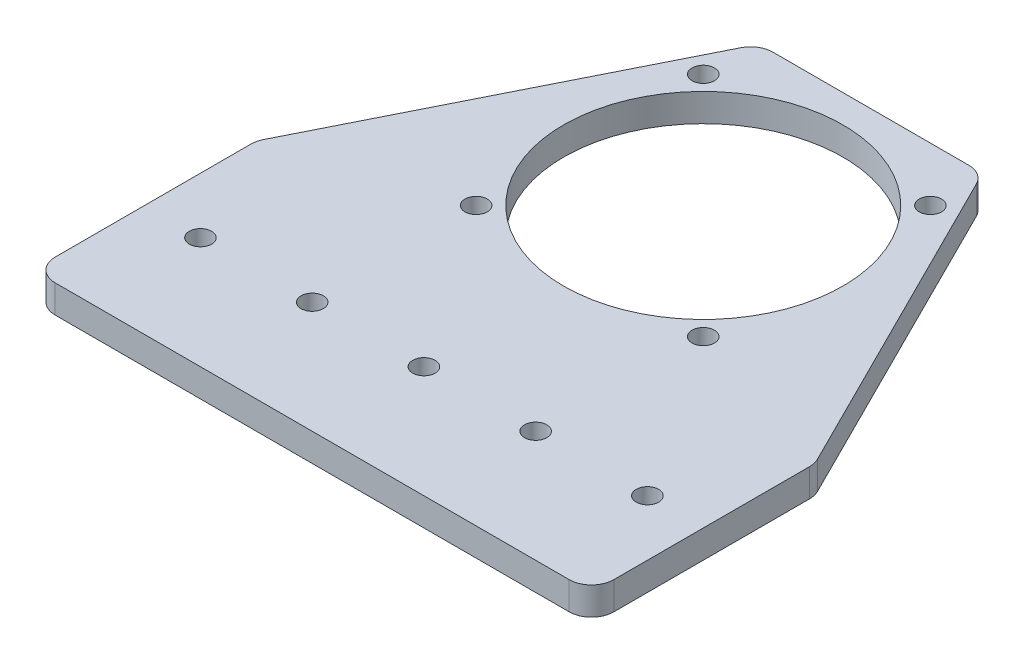
ISO-10303-21;
HEADER;
FILE_DESCRIPTION(('STEP AP214'),'2;1');
FILE_NAME('part.step','',(''),(''),'','','');
FILE_SCHEMA(('AUTOMOTIVE_DESIGN { 1 0 10303 214 1 1 1 1 }'));
ENDSEC;
DATA;
#1=APPLICATION_CONTEXT('core data for automotive mechanical design processes');
#2=APPLICATION_PROTOCOL_DEFINITION('international standard','automotive_design',2000,#1);
#3=PRODUCT_CONTEXT('',#1,'mechanical');
#4=PRODUCT('Part','Part','',(#3));
#5=PRODUCT_RELATED_PRODUCT_CATEGORY('part','',(#4));
#6=PRODUCT_DEFINITION_FORMATION('','',#4);
#7=PRODUCT_DEFINITION_CONTEXT('part definition',#1,'design');
#8=PRODUCT_DEFINITION('design','',#6,#7);
#9=PRODUCT_DEFINITION_SHAPE('','',#8);
#10=(LENGTH_UNIT() NAMED_UNIT(*) SI_UNIT(.MILLI.,.METRE.));
#11=(NAMED_UNIT(*) PLANE_ANGLE_UNIT() SI_UNIT($,.RADIAN.));
#12=(NAMED_UNIT(*) SI_UNIT($,.STERADIAN.) SOLID_ANGLE_UNIT());
#13=UNCERTAINTY_MEASURE_WITH_UNIT(LENGTH_MEASURE(1.E-05),#10,'distance_accuracy_value','');
#14=(GEOMETRIC_REPRESENTATION_CONTEXT(3) GLOBAL_UNCERTAINTY_ASSIGNED_CONTEXT((#13)) GLOBAL_UNIT_ASSIGNED_CONTEXT((#10,
#11,#12)) REPRESENTATION_CONTEXT('',''));
#15=CARTESIAN_POINT('',(0.,0.,0.));
#16=DIRECTION('',(0.,0.,1.));
#17=DIRECTION('',(1.,0.,0.));
#18=AXIS2_PLACEMENT_3D('',#15,#16,#17);
#19=CARTESIAN_POINT('',(25.4,3.175,19.05));
#20=DIRECTION('',(0.,-1.,0.));
#21=DIRECTION('',(0.,0.,-1.));
#22=AXIS2_PLACEMENT_3D('',#19,#20,#21);
#23=CYLINDRICAL_SURFACE('',#22,1.27);
#24=CARTESIAN_POINT('',(25.4,3.175,19.05));
#25=DIRECTION('',(0.,1.,0.));
#26=DIRECTION('',(0.,0.,1.));
#27=AXIS2_PLACEMENT_3D('',#24,#25,#26);
#28=CIRCLE('',#27,1.27);
#29=CARTESIAN_POINT('',(25.4,3.175,20.32));
#30=VERTEX_POINT('',#29);
#31=EDGE_CURVE('E52',#30,#30,#28,.T.);
#32=ORIENTED_EDGE('',*,*,#31,.T.);
#33=EDGE_LOOP('',(#32));
#34=FACE_BOUND('',#33,.T.);
#35=CARTESIAN_POINT('',(25.4,0.,19.05));
#36=DIRECTION('',(0.,1.,0.));
#37=DIRECTION('',(0.,0.,1.));
#38=AXIS2_PLACEMENT_3D('',#35,#36,#37);
#39=CIRCLE('',#38,1.27);
#40=CARTESIAN_POINT('',(25.4,0.,20.32));
#41=VERTEX_POINT('',#40);
#42=EDGE_CURVE('E11',#41,#41,#39,.T.);
#43=ORIENTED_EDGE('',*,*,#42,.F.);
#44=EDGE_LOOP('',(#43));
#45=FACE_BOUND('',#44,.T.);
#46=ADVANCED_FACE('F45',(#34,#45),#23,.F.);
#47=CARTESIAN_POINT('',(12.7,3.175,19.05));
#48=DIRECTION('',(0.,-1.,0.));
#49=DIRECTION('',(0.,0.,-1.));
#50=AXIS2_PLACEMENT_3D('',#47,#48,#49);
#51=CYLINDRICAL_SURFACE('',#50,1.27);
#52=CARTESIAN_POINT('',(12.7,3.175,19.05));
#53=DIRECTION('',(0.,1.,0.));
#54=DIRECTION('',(0.,0.,1.));
#55=AXIS2_PLACEMENT_3D('',#52,#53,#54);
#56=CIRCLE('',#55,1.27);
#57=CARTESIAN_POINT('',(12.7,3.175,20.32));
#58=VERTEX_POINT('',#57);
#59=EDGE_CURVE('E218',#58,#58,#56,.T.);
#60=ORIENTED_EDGE('',*,*,#59,.T.);
#61=EDGE_LOOP('',(#60));
#62=FACE_BOUND('',#61,.T.);
#63=CARTESIAN_POINT('',(12.7,0.,19.05));
#64=DIRECTION('',(0.,1.,0.));
#65=DIRECTION('',(0.,0.,1.));
#66=AXIS2_PLACEMENT_3D('',#63,#64,#65);
#67=CIRCLE('',#66,1.27);
#68=CARTESIAN_POINT('',(12.7,0.,20.32));
#69=VERTEX_POINT('',#68);
#70=EDGE_CURVE('E221',#69,#69,#67,.T.);
#71=ORIENTED_EDGE('',*,*,#70,.F.);
#72=EDGE_LOOP('',(#71));
#73=FACE_BOUND('',#72,.T.);
#74=ADVANCED_FACE('F358',(#62,#73),#51,.F.);
#75=CARTESIAN_POINT('',(0.,3.175,19.05));
#76=DIRECTION('',(0.,-1.,0.));
#77=DIRECTION('',(0.,0.,-1.));
#78=AXIS2_PLACEMENT_3D('',#75,#76,#77);
#79=CYLINDRICAL_SURFACE('',#78,1.27);
#80=CARTESIAN_POINT('',(0.,3.175,19.05));
#81=DIRECTION('',(0.,1.,0.));
#82=DIRECTION('',(0.,0.,1.));
#83=AXIS2_PLACEMENT_3D('',#80,#81,#82);
#84=CIRCLE('',#83,1.27);
#85=CARTESIAN_POINT('',(0.,3.175,20.32));
#86=VERTEX_POINT('',#85);
#87=EDGE_CURVE('E212',#86,#86,#84,.T.);
#88=ORIENTED_EDGE('',*,*,#87,.T.);
#89=EDGE_LOOP('',(#88));
#90=FACE_BOUND('',#89,.T.);
#91=CARTESIAN_POINT('',(0.,0.,19.05));
#92=DIRECTION('',(0.,1.,0.));
#93=DIRECTION('',(0.,0.,1.));
#94=AXIS2_PLACEMENT_3D('',#91,#92,#93);
#95=CIRCLE('',#94,1.27);
#96=CARTESIAN_POINT('',(0.,0.,20.32));
#97=VERTEX_POINT('',#96);
#98=EDGE_CURVE('E215',#97,#97,#95,.T.);
#99=ORIENTED_EDGE('',*,*,#98,.F.);
#100=EDGE_LOOP('',(#99));
#101=FACE_BOUND('',#100,.T.);
#102=ADVANCED_FACE('F362',(#90,#101),#79,.F.);
#103=CARTESIAN_POINT('',(-12.7,3.175,19.05));
#104=DIRECTION('',(0.,-1.,0.));
#105=DIRECTION('',(0.,0.,-1.));
#106=AXIS2_PLACEMENT_3D('',#103,#104,#105);
#107=CYLINDRICAL_SURFACE('',#106,1.27);
#108=CARTESIAN_POINT('',(-12.7,3.175,19.05));
#109=DIRECTION('',(0.,1.,0.));
#110=DIRECTION('',(0.,0.,1.));
#111=AXIS2_PLACEMENT_3D('',#108,#109,#110);
#112=CIRCLE('',#111,1.27);
#113=CARTESIAN_POINT('',(-12.7,3.175,20.32));
#114=VERTEX_POINT('',#113);
#115=EDGE_CURVE('E206',#114,#114,#112,.T.);
#116=ORIENTED_EDGE('',*,*,#115,.T.);
#117=EDGE_LOOP('',(#116));
#118=FACE_BOUND('',#117,.T.);
#119=CARTESIAN_POINT('',(-12.7,0.,19.05));
#120=DIRECTION('',(0.,1.,0.));
#121=DIRECTION('',(0.,0.,1.));
#122=AXIS2_PLACEMENT_3D('',#119,#120,#121);
#123=CIRCLE('',#122,1.27);
#124=CARTESIAN_POINT('',(-12.7,0.,20.32));
#125=VERTEX_POINT('',#124);
#126=EDGE_CURVE('E209',#125,#125,#123,.T.);
#127=ORIENTED_EDGE('',*,*,#126,.F.);
#128=EDGE_LOOP('',(#127));
#129=FACE_BOUND('',#128,.T.);
#130=ADVANCED_FACE('F367',(#118,#129),#107,.F.);
#131=CARTESIAN_POINT('',(31.75,3.175,0.));
#132=DIRECTION('',(-1.,0.,0.));
#133=DIRECTION('',(0.,0.,1.));
#134=AXIS2_PLACEMENT_3D('',#131,#132,#133);
#135=PLANE('',#134);
#136=DIRECTION('',(0.,0.,-1.));
#137=VECTOR('',#136,1.);
#138=CARTESIAN_POINT('',(31.75,3.175,0.));
#139=LINE('',#138,#137);
#140=CARTESIAN_POINT('',(31.75,3.175,29.21));
#141=VERTEX_POINT('',#140);
#142=CARTESIAN_POINT('',(31.75,3.175,6.94961266284948));
#143=VERTEX_POINT('',#142);
#144=EDGE_CURVE('E313',#141,#143,#139,.T.);
#145=ORIENTED_EDGE('',*,*,#144,.F.);
#146=DIRECTION('',(0.,-1.,0.));
#147=VECTOR('',#146,1.);
#148=CARTESIAN_POINT('',(31.75,3.175,29.21));
#149=LINE('',#148,#147);
#150=CARTESIAN_POINT('',(31.75,0.,29.21));
#151=VERTEX_POINT('',#150);
#152=EDGE_CURVE('E193',#141,#151,#149,.T.);
#153=ORIENTED_EDGE('',*,*,#152,.T.);
#154=DIRECTION('',(0.,0.,-1.));
#155=VECTOR('',#154,1.);
#156=CARTESIAN_POINT('',(31.75,0.,0.));
#157=LINE('',#156,#155);
#158=CARTESIAN_POINT('',(31.75,0.,6.94961266284948));
#159=VERTEX_POINT('',#158);
#160=EDGE_CURVE('E286',#151,#159,#157,.T.);
#161=ORIENTED_EDGE('',*,*,#160,.T.);
#162=DIRECTION('',(0.,-1.,0.));
#163=VECTOR('',#162,1.);
#164=CARTESIAN_POINT('',(31.75,3.175,6.94961266284948));
#165=LINE('',#164,#163);
#166=EDGE_CURVE('E191',#159,#143,#165,.F.);
#167=ORIENTED_EDGE('',*,*,#166,.T.);
#168=EDGE_LOOP('',(#145,#153,#161,#167));
#169=FACE_BOUND('',#168,.T.);
#170=ADVANCED_FACE('F329',(#169),#135,.F.);
#171=CARTESIAN_POINT('',(22.86,3.175,-11.43));
#172=DIRECTION('',(-0.894427190999916,0.,0.447213595499958));
#173=DIRECTION('',(0.447213595499958,0.,0.894427190999916));
#174=AXIS2_PLACEMENT_3D('',#171,#172,#173);
#175=PLANE('',#174);
#176=DIRECTION('',(-0.447213595499958,0.,-0.894427190999916));
#177=VECTOR('',#176,1.);
#178=CARTESIAN_POINT('',(22.86,3.175,-11.43));
#179=LINE('',#178,#177);
#180=CARTESIAN_POINT('',(31.4818450651398,3.175,5.81369013027958));
#181=VERTEX_POINT('',#180);
#182=CARTESIAN_POINT('',(13.402038733715,3.175,-30.3459225325699));
#183=VERTEX_POINT('',#182);
#184=EDGE_CURVE('E310',#181,#183,#179,.T.);
#185=ORIENTED_EDGE('',*,*,#184,.F.);
#186=DIRECTION('',(0.,-1.,0.));
#187=VECTOR('',#186,1.);
#188=CARTESIAN_POINT('',(31.4818450651398,3.175,5.81369013027958));
#189=LINE('',#188,#187);
#190=CARTESIAN_POINT('',(31.4818450651398,0.,5.81369013027958));
#191=VERTEX_POINT('',#190);
#192=EDGE_CURVE('E198',#181,#191,#189,.T.);
#193=ORIENTED_EDGE('',*,*,#192,.T.);
#194=DIRECTION('',(-0.447213595499958,0.,-0.894427190999916));
#195=VECTOR('',#194,1.);
#196=CARTESIAN_POINT('',(22.86,0.,-11.43));
#197=LINE('',#196,#195);
#198=CARTESIAN_POINT('',(13.402038733715,0.,-30.3459225325699));
#199=VERTEX_POINT('',#198);
#200=EDGE_CURVE('E281',#191,#199,#197,.T.);
#201=ORIENTED_EDGE('',*,*,#200,.T.);
#202=DIRECTION('',(0.,-1.,0.));
#203=VECTOR('',#202,1.);
#204=CARTESIAN_POINT('',(13.402038733715,3.175,-30.3459225325699));
#205=LINE('',#204,#203);
#206=EDGE_CURVE('E196',#199,#183,#205,.F.);
#207=ORIENTED_EDGE('',*,*,#206,.T.);
#208=EDGE_LOOP('',(#185,#193,#201,#207));
#209=FACE_BOUND('',#208,.T.);
#210=ADVANCED_FACE('F338',(#209),#175,.F.);
#211=CARTESIAN_POINT('',(0.,3.175,-31.75));
#212=DIRECTION('',(0.,0.,-1.));
#213=DIRECTION('',(-1.,0.,0.));
#214=AXIS2_PLACEMENT_3D('',#211,#212,#213);
#215=PLANE('',#214);
#216=DIRECTION('',(1.,0.,0.));
#217=VECTOR('',#216,1.);
#218=CARTESIAN_POINT('',(0.,3.175,-31.75));
#219=LINE('',#218,#217);
#220=CARTESIAN_POINT('',(-11.1301936685753,3.175,-31.75));
#221=VERTEX_POINT('',#220);
#222=CARTESIAN_POINT('',(11.1301936685753,3.175,-31.75));
#223=VERTEX_POINT('',#222);
#224=EDGE_CURVE('E270',#221,#223,#219,.T.);
#225=ORIENTED_EDGE('',*,*,#224,.T.);
#226=DIRECTION('',(0.,-1.,0.));
#227=VECTOR('',#226,1.);
#228=CARTESIAN_POINT('',(11.1301936685753,0.,-31.75));
#229=LINE('',#228,#227);
#230=CARTESIAN_POINT('',(11.1301936685753,0.,-31.75));
#231=VERTEX_POINT('',#230);
#232=EDGE_CURVE('E203',#223,#231,#229,.T.);
#233=ORIENTED_EDGE('',*,*,#232,.T.);
#234=DIRECTION('',(1.,0.,0.));
#235=VECTOR('',#234,1.);
#236=CARTESIAN_POINT('',(0.,0.,-31.75));
#237=LINE('',#236,#235);
#238=CARTESIAN_POINT('',(-11.1301936685753,0.,-31.75));
#239=VERTEX_POINT('',#238);
#240=EDGE_CURVE('E278',#239,#231,#237,.T.);
#241=ORIENTED_EDGE('',*,*,#240,.F.);
#242=DIRECTION('',(0.,-1.,0.));
#243=VECTOR('',#242,1.);
#244=CARTESIAN_POINT('',(-11.1301936685753,3.175,-31.75));
#245=LINE('',#244,#243);
#246=EDGE_CURVE('E201',#239,#221,#245,.F.);
#247=ORIENTED_EDGE('',*,*,#246,.T.);
#248=EDGE_LOOP('',(#225,#233,#241,#247));
#249=FACE_BOUND('',#248,.T.);
#250=ADVANCED_FACE('F345',(#249),#215,.T.);
#251=CARTESIAN_POINT('',(-22.86,3.175,-11.43));
#252=DIRECTION('',(-0.894427190999916,0.,-0.447213595499958));
#253=DIRECTION('',(-0.447213595499958,0.,0.894427190999916));
#254=AXIS2_PLACEMENT_3D('',#251,#252,#253);
#255=PLANE('',#254);
#256=DIRECTION('',(0.447213595499958,0.,-0.894427190999916));
#257=VECTOR('',#256,1.);
#258=CARTESIAN_POINT('',(-22.86,0.,-11.43));
#259=LINE('',#258,#257);
#260=CARTESIAN_POINT('',(-31.4818450651398,0.,5.81369013027959));
#261=VERTEX_POINT('',#260);
#262=CARTESIAN_POINT('',(-13.402038733715,0.,-30.3459225325699));
#263=VERTEX_POINT('',#262);
#264=EDGE_CURVE('E154',#261,#263,#259,.T.);
#265=ORIENTED_EDGE('',*,*,#264,.F.);
#266=DIRECTION('',(0.,-1.,0.));
#267=VECTOR('',#266,1.);
#268=CARTESIAN_POINT('',(-31.4818450651398,3.175,5.81369013027959));
#269=LINE('',#268,#267);
#270=CARTESIAN_POINT('',(-31.4818450651398,3.175,5.81369013027959));
#271=VERTEX_POINT('',#270);
#272=EDGE_CURVE('E175',#261,#271,#269,.F.);
#273=ORIENTED_EDGE('',*,*,#272,.T.);
#274=DIRECTION('',(0.447213595499958,0.,-0.894427190999916));
#275=VECTOR('',#274,1.);
#276=CARTESIAN_POINT('',(-22.86,3.175,-11.43));
#277=LINE('',#276,#275);
#278=CARTESIAN_POINT('',(-13.402038733715,3.175,-30.3459225325699));
#279=VERTEX_POINT('',#278);
#280=EDGE_CURVE('E264',#271,#279,#277,.T.);
#281=ORIENTED_EDGE('',*,*,#280,.T.);
#282=DIRECTION('',(0.,-1.,0.));
#283=VECTOR('',#282,1.);
#284=CARTESIAN_POINT('',(-13.402038733715,3.175,-30.3459225325699));
#285=LINE('',#284,#283);
#286=EDGE_CURVE('E172',#279,#263,#285,.T.);
#287=ORIENTED_EDGE('',*,*,#286,.T.);
#288=EDGE_LOOP('',(#265,#273,#281,#287));
#289=FACE_BOUND('',#288,.T.);
#290=ADVANCED_FACE('F277',(#289),#255,.T.);
#291=CARTESIAN_POINT('',(-31.75,3.175,0.));
#292=DIRECTION('',(-1.,0.,0.));
#293=DIRECTION('',(0.,0.,1.));
#294=AXIS2_PLACEMENT_3D('',#291,#292,#293);
#295=PLANE('',#294);
#296=DIRECTION('',(0.,0.,-1.));
#297=VECTOR('',#296,1.);
#298=CARTESIAN_POINT('',(-31.75,3.175,0.));
#299=LINE('',#298,#297);
#300=CARTESIAN_POINT('',(-31.75,3.175,29.21));
#301=VERTEX_POINT('',#300);
#302=CARTESIAN_POINT('',(-31.75,3.175,6.94961266284949));
#303=VERTEX_POINT('',#302);
#304=EDGE_CURVE('E161',#301,#303,#299,.T.);
#305=ORIENTED_EDGE('',*,*,#304,.T.);
#306=DIRECTION('',(0.,-1.,0.));
#307=VECTOR('',#306,1.);
#308=CARTESIAN_POINT('',(-31.75,3.175,6.94961266284949));
#309=LINE('',#308,#307);
#310=CARTESIAN_POINT('',(-31.75,0.,6.94961266284949));
#311=VERTEX_POINT('',#310);
#312=EDGE_CURVE('E153',#303,#311,#309,.T.);
#313=ORIENTED_EDGE('',*,*,#312,.T.);
#314=DIRECTION('',(0.,0.,-1.));
#315=VECTOR('',#314,1.);
#316=CARTESIAN_POINT('',(-31.75,0.,0.));
#317=LINE('',#316,#315);
#318=CARTESIAN_POINT('',(-31.75,0.,29.21));
#319=VERTEX_POINT('',#318);
#320=EDGE_CURVE('E138',#319,#311,#317,.T.);
#321=ORIENTED_EDGE('',*,*,#320,.F.);
#322=DIRECTION('',(0.,-1.,0.));
#323=VECTOR('',#322,1.);
#324=CARTESIAN_POINT('',(-31.75,3.175,29.21));
#325=LINE('',#324,#323);
#326=EDGE_CURVE('E151',#319,#301,#325,.F.);
#327=ORIENTED_EDGE('',*,*,#326,.T.);
#328=EDGE_LOOP('',(#305,#313,#321,#327));
#329=FACE_BOUND('',#328,.T.);
#330=ADVANCED_FACE('F150',(#329),#295,.T.);
#331=CARTESIAN_POINT('',(-12.9091181740368,3.175,0.209118174036975));
#332=DIRECTION('',(0.,-1.,0.));
#333=DIRECTION('',(0.,0.,-1.));
#334=AXIS2_PLACEMENT_3D('',#331,#332,#333);
#335=CYLINDRICAL_SURFACE('',#334,1.27);
#336=CARTESIAN_POINT('',(-12.9091181740368,3.175,0.209118174036975));
#337=DIRECTION('',(0.,1.,0.));
#338=DIRECTION('',(0.,0.,1.));
#339=AXIS2_PLACEMENT_3D('',#336,#337,#338);
#340=CIRCLE('',#339,1.27);
#341=CARTESIAN_POINT('',(-12.9091181740368,3.175,1.47911817403697));
#342=VERTEX_POINT('',#341);
#343=EDGE_CURVE('E261',#342,#342,#340,.T.);
#344=ORIENTED_EDGE('',*,*,#343,.T.);
#345=EDGE_LOOP('',(#344));
#346=FACE_BOUND('',#345,.T.);
#347=CARTESIAN_POINT('',(-12.9091181740368,0.,0.209118174036975));
#348=DIRECTION('',(0.,1.,0.));
#349=DIRECTION('',(0.,0.,1.));
#350=AXIS2_PLACEMENT_3D('',#347,#348,#349);
#351=CIRCLE('',#350,1.27);
#352=CARTESIAN_POINT('',(-12.9091181740368,0.,1.47911817403697));
#353=VERTEX_POINT('',#352);
#354=EDGE_CURVE('E289',#353,#353,#351,.T.);
#355=ORIENTED_EDGE('',*,*,#354,.F.);
#356=EDGE_LOOP('',(#355));
#357=FACE_BOUND('',#356,.T.);
#358=ADVANCED_FACE('F396',(#346,#357),#335,.F.);
#359=CARTESIAN_POINT('',(-25.4,3.175,19.05));
#360=DIRECTION('',(0.,-1.,0.));
#361=DIRECTION('',(0.,0.,-1.));
#362=AXIS2_PLACEMENT_3D('',#359,#360,#361);
#363=CYLINDRICAL_SURFACE('',#362,1.27);
#364=CARTESIAN_POINT('',(-25.4,3.175,19.05));
#365=DIRECTION('',(0.,1.,0.));
#366=DIRECTION('',(0.,0.,1.));
#367=AXIS2_PLACEMENT_3D('',#364,#365,#366);
#368=CIRCLE('',#367,1.27);
#369=CARTESIAN_POINT('',(-25.4,3.175,20.32));
#370=VERTEX_POINT('',#369);
#371=EDGE_CURVE('E258',#370,#370,#368,.T.);
#372=ORIENTED_EDGE('',*,*,#371,.T.);
#373=EDGE_LOOP('',(#372));
#374=FACE_BOUND('',#373,.T.);
#375=CARTESIAN_POINT('',(-25.4,0.,19.05));
#376=DIRECTION('',(0.,1.,0.));
#377=DIRECTION('',(0.,0.,1.));
#378=AXIS2_PLACEMENT_3D('',#375,#376,#377);
#379=CIRCLE('',#378,1.27);
#380=CARTESIAN_POINT('',(-25.4,0.,20.32));
#381=VERTEX_POINT('',#380);
#382=EDGE_CURVE('E292',#381,#381,#379,.T.);
#383=ORIENTED_EDGE('',*,*,#382,.F.);
#384=EDGE_LOOP('',(#383));
#385=FACE_BOUND('',#384,.T.);
#386=ADVANCED_FACE('F398',(#374,#385),#363,.F.);
#387=CARTESIAN_POINT('',(-12.909118174037,3.175,-25.6091181740368));
#388=DIRECTION('',(0.,-1.,0.));
#389=DIRECTION('',(0.,0.,-1.));
#390=AXIS2_PLACEMENT_3D('',#387,#388,#389);
#391=CYLINDRICAL_SURFACE('',#390,1.27);
#392=CARTESIAN_POINT('',(-12.909118174037,3.175,-25.6091181740368));
#393=DIRECTION('',(0.,1.,0.));
#394=DIRECTION('',(0.,0.,1.));
#395=AXIS2_PLACEMENT_3D('',#392,#393,#394);
#396=CIRCLE('',#395,1.27);
#397=CARTESIAN_POINT('',(-12.909118174037,3.175,-24.3391181740368));
#398=VERTEX_POINT('',#397);
#399=EDGE_CURVE('E254',#398,#398,#396,.T.);
#400=ORIENTED_EDGE('',*,*,#399,.T.);
#401=EDGE_LOOP('',(#400));
#402=FACE_BOUND('',#401,.T.);
#403=CARTESIAN_POINT('',(-12.909118174037,0.,-25.6091181740368));
#404=DIRECTION('',(0.,1.,0.));
#405=DIRECTION('',(0.,0.,1.));
#406=AXIS2_PLACEMENT_3D('',#403,#404,#405);
#407=CIRCLE('',#406,1.27);
#408=CARTESIAN_POINT('',(-12.909118174037,0.,-24.3391181740368));
#409=VERTEX_POINT('',#408);
#410=EDGE_CURVE('E295',#409,#409,#407,.T.);
#411=ORIENTED_EDGE('',*,*,#410,.F.);
#412=EDGE_LOOP('',(#411));
#413=FACE_BOUND('',#412,.T.);
#414=ADVANCED_FACE('F404',(#402,#413),#391,.F.);
#415=CARTESIAN_POINT('',(12.909118174037,3.175,0.209118174036838));
#416=DIRECTION('',(0.,-1.,0.));
#417=DIRECTION('',(0.,0.,-1.));
#418=AXIS2_PLACEMENT_3D('',#415,#416,#417);
#419=CYLINDRICAL_SURFACE('',#418,1.27);
#420=CARTESIAN_POINT('',(12.909118174037,3.175,0.209118174036838));
#421=DIRECTION('',(0.,1.,0.));
#422=DIRECTION('',(0.,0.,1.));
#423=AXIS2_PLACEMENT_3D('',#420,#421,#422);
#424=CIRCLE('',#423,1.27);
#425=CARTESIAN_POINT('',(12.909118174037,3.175,1.47911817403684));
#426=VERTEX_POINT('',#425);
#427=EDGE_CURVE('E250',#426,#426,#424,.T.);
#428=ORIENTED_EDGE('',*,*,#427,.T.);
#429=EDGE_LOOP('',(#428));
#430=FACE_BOUND('',#429,.T.);
#431=CARTESIAN_POINT('',(12.909118174037,0.,0.209118174036838));
#432=DIRECTION('',(0.,1.,0.));
#433=DIRECTION('',(0.,0.,1.));
#434=AXIS2_PLACEMENT_3D('',#431,#432,#433);
#435=CIRCLE('',#434,1.27);
#436=CARTESIAN_POINT('',(12.909118174037,0.,1.47911817403684));
#437=VERTEX_POINT('',#436);
#438=EDGE_CURVE('E298',#437,#437,#435,.T.);
#439=ORIENTED_EDGE('',*,*,#438,.F.);
#440=EDGE_LOOP('',(#439));
#441=FACE_BOUND('',#440,.T.);
#442=ADVANCED_FACE('F413',(#430,#441),#419,.F.);
#443=CARTESIAN_POINT('',(12.9091181740368,3.175,-25.609118174037));
#444=DIRECTION('',(0.,-1.,0.));
#445=DIRECTION('',(0.,0.,-1.));
#446=AXIS2_PLACEMENT_3D('',#443,#444,#445);
#447=CYLINDRICAL_SURFACE('',#446,1.27);
#448=CARTESIAN_POINT('',(12.9091181740368,3.175,-25.609118174037));
#449=DIRECTION('',(0.,1.,0.));
#450=DIRECTION('',(0.,0.,1.));
#451=AXIS2_PLACEMENT_3D('',#448,#449,#450);
#452=CIRCLE('',#451,1.27);
#453=CARTESIAN_POINT('',(12.9091181740368,3.175,-24.339118174037));
#454=VERTEX_POINT('',#453);
#455=EDGE_CURVE('E246',#454,#454,#452,.T.);
#456=ORIENTED_EDGE('',*,*,#455,.T.);
#457=EDGE_LOOP('',(#456));
#458=FACE_BOUND('',#457,.T.);
#459=CARTESIAN_POINT('',(12.9091181740368,0.,-25.609118174037));
#460=DIRECTION('',(0.,1.,0.));
#461=DIRECTION('',(0.,0.,1.));
#462=AXIS2_PLACEMENT_3D('',#459,#460,#461);
#463=CIRCLE('',#462,1.27);
#464=CARTESIAN_POINT('',(12.9091181740368,0.,-24.339118174037));
#465=VERTEX_POINT('',#464);
#466=EDGE_CURVE('E301',#465,#465,#463,.T.);
#467=ORIENTED_EDGE('',*,*,#466,.F.);
#468=EDGE_LOOP('',(#467));
#469=FACE_BOUND('',#468,.T.);
#470=ADVANCED_FACE('F417',(#458,#469),#447,.F.);
#471=CARTESIAN_POINT('',(0.,3.175,-12.7));
#472=DIRECTION('',(0.,-1.,0.));
#473=DIRECTION('',(0.,0.,-1.));
#474=AXIS2_PLACEMENT_3D('',#471,#472,#473);
#475=CYLINDRICAL_SURFACE('',#474,15.875);
#476=CARTESIAN_POINT('',(0.,3.175,-12.7));
#477=DIRECTION('',(0.,1.,0.));
#478=DIRECTION('',(0.,0.,1.));
#479=AXIS2_PLACEMENT_3D('',#476,#477,#478);
#480=CIRCLE('',#479,15.875);
#481=CARTESIAN_POINT('',(0.,3.175,3.17499999999999));
#482=VERTEX_POINT('',#481);
#483=EDGE_CURVE('E242',#482,#482,#480,.T.);
#484=ORIENTED_EDGE('',*,*,#483,.T.);
#485=EDGE_LOOP('',(#484));
#486=FACE_BOUND('',#485,.T.);
#487=CARTESIAN_POINT('',(0.,0.,-12.7));
#488=DIRECTION('',(0.,1.,0.));
#489=DIRECTION('',(0.,0.,1.));
#490=AXIS2_PLACEMENT_3D('',#487,#488,#489);
#491=CIRCLE('',#490,15.875);
#492=CARTESIAN_POINT('',(0.,0.,3.17499999999999));
#493=VERTEX_POINT('',#492);
#494=EDGE_CURVE('E304',#493,#493,#491,.T.);
#495=ORIENTED_EDGE('',*,*,#494,.F.);
#496=EDGE_LOOP('',(#495));
#497=FACE_BOUND('',#496,.T.);
#498=ADVANCED_FACE('F421',(#486,#497),#475,.F.);
#499=CARTESIAN_POINT('',(0.,3.175,31.75));
#500=DIRECTION('',(0.,0.,-1.));
#501=DIRECTION('',(-1.,0.,0.));
#502=AXIS2_PLACEMENT_3D('',#499,#500,#501);
#503=PLANE('',#502);
#504=DIRECTION('',(1.,0.,0.));
#505=VECTOR('',#504,1.);
#506=CARTESIAN_POINT('',(0.,3.175,31.75));
#507=LINE('',#506,#505);
#508=CARTESIAN_POINT('',(-29.21,3.175,31.75));
#509=VERTEX_POINT('',#508);
#510=CARTESIAN_POINT('',(29.21,3.175,31.75));
#511=VERTEX_POINT('',#510);
#512=EDGE_CURVE('E157',#509,#511,#507,.T.);
#513=ORIENTED_EDGE('',*,*,#512,.F.);
#514=DIRECTION('',(0.,-1.,0.));
#515=VECTOR('',#514,1.);
#516=CARTESIAN_POINT('',(-29.21,0.,31.75));
#517=LINE('',#516,#515);
#518=CARTESIAN_POINT('',(-29.21,0.,31.75));
#519=VERTEX_POINT('',#518);
#520=EDGE_CURVE('E189',#509,#519,#517,.T.);
#521=ORIENTED_EDGE('',*,*,#520,.T.);
#522=DIRECTION('',(1.,0.,0.));
#523=VECTOR('',#522,1.);
#524=CARTESIAN_POINT('',(0.,0.,31.75));
#525=LINE('',#524,#523);
#526=CARTESIAN_POINT('',(29.21,0.,31.75));
#527=VERTEX_POINT('',#526);
#528=EDGE_CURVE('E139',#519,#527,#525,.T.);
#529=ORIENTED_EDGE('',*,*,#528,.T.);
#530=DIRECTION('',(0.,-1.,0.));
#531=VECTOR('',#530,1.);
#532=CARTESIAN_POINT('',(29.21,3.175,31.75));
#533=LINE('',#532,#531);
#534=EDGE_CURVE('E59',#527,#511,#533,.F.);
#535=ORIENTED_EDGE('',*,*,#534,.T.);
#536=EDGE_LOOP('',(#513,#521,#529,#535));
#537=FACE_BOUND('',#536,.T.);
#538=ADVANCED_FACE('F231',(#537),#503,.F.);
#539=CARTESIAN_POINT('',(0.,3.175,0.));
#540=DIRECTION('',(0.,1.,0.));
#541=DIRECTION('',(0.,0.,1.));
#542=AXIS2_PLACEMENT_3D('',#539,#540,#541);
#543=PLANE('',#542);
#544=ORIENTED_EDGE('',*,*,#31,.F.);
#545=EDGE_LOOP('',(#544));
#546=FACE_BOUND('',#545,.T.);
#547=ORIENTED_EDGE('',*,*,#59,.F.);
#548=EDGE_LOOP('',(#547));
#549=FACE_BOUND('',#548,.T.);
#550=ORIENTED_EDGE('',*,*,#87,.F.);
#551=EDGE_LOOP('',(#550));
#552=FACE_BOUND('',#551,.T.);
#553=ORIENTED_EDGE('',*,*,#115,.F.);
#554=EDGE_LOOP('',(#553));
#555=FACE_BOUND('',#554,.T.);
#556=ORIENTED_EDGE('',*,*,#483,.F.);
#557=EDGE_LOOP('',(#556));
#558=FACE_BOUND('',#557,.T.);
#559=ORIENTED_EDGE('',*,*,#455,.F.);
#560=EDGE_LOOP('',(#559));
#561=FACE_BOUND('',#560,.T.);
#562=ORIENTED_EDGE('',*,*,#427,.F.);
#563=EDGE_LOOP('',(#562));
#564=FACE_BOUND('',#563,.T.);
#565=ORIENTED_EDGE('',*,*,#399,.F.);
#566=EDGE_LOOP('',(#565));
#567=FACE_BOUND('',#566,.T.);
#568=ORIENTED_EDGE('',*,*,#371,.F.);
#569=EDGE_LOOP('',(#568));
#570=FACE_BOUND('',#569,.T.);
#571=ORIENTED_EDGE('',*,*,#343,.F.);
#572=EDGE_LOOP('',(#571));
#573=FACE_BOUND('',#572,.T.);
#574=ORIENTED_EDGE('',*,*,#280,.F.);
#575=CARTESIAN_POINT('',(-29.21,3.175,6.94961266284949));
#576=DIRECTION('',(0.,1.,0.));
#577=DIRECTION('',(0.,0.,1.));
#578=AXIS2_PLACEMENT_3D('',#575,#576,#577);
#579=CIRCLE('',#578,2.54);
#580=EDGE_CURVE('E186',#271,#303,#579,.T.);
#581=ORIENTED_EDGE('',*,*,#580,.T.);
#582=ORIENTED_EDGE('',*,*,#304,.F.);
#583=CARTESIAN_POINT('',(-29.21,3.175,29.21));
#584=DIRECTION('',(0.,1.,0.));
#585=DIRECTION('',(0.,0.,1.));
#586=AXIS2_PLACEMENT_3D('',#583,#584,#585);
#587=CIRCLE('',#586,2.54);
#588=EDGE_CURVE('E66',#301,#509,#587,.T.);
#589=ORIENTED_EDGE('',*,*,#588,.T.);
#590=ORIENTED_EDGE('',*,*,#512,.T.);
#591=CARTESIAN_POINT('',(29.21,3.175,29.21));
#592=DIRECTION('',(0.,1.,0.));
#593=DIRECTION('',(0.,0.,1.));
#594=AXIS2_PLACEMENT_3D('',#591,#592,#593);
#595=CIRCLE('',#594,2.54);
#596=EDGE_CURVE('E183',#511,#141,#595,.T.);
#597=ORIENTED_EDGE('',*,*,#596,.T.);
#598=ORIENTED_EDGE('',*,*,#144,.T.);
#599=CARTESIAN_POINT('',(29.21,3.175,6.94961266284948));
#600=DIRECTION('',(0.,1.,0.));
#601=DIRECTION('',(0.,0.,1.));
#602=AXIS2_PLACEMENT_3D('',#599,#600,#601);
#603=CIRCLE('',#602,2.54);
#604=EDGE_CURVE('E181',#143,#181,#603,.T.);
#605=ORIENTED_EDGE('',*,*,#604,.T.);
#606=ORIENTED_EDGE('',*,*,#184,.T.);
#607=CARTESIAN_POINT('',(11.1301936685753,3.175,-29.21));
#608=DIRECTION('',(0.,1.,0.));
#609=DIRECTION('',(0.,0.,1.));
#610=AXIS2_PLACEMENT_3D('',#607,#608,#609);
#611=CIRCLE('',#610,2.54);
#612=EDGE_CURVE('E179',#183,#223,#611,.T.);
#613=ORIENTED_EDGE('',*,*,#612,.T.);
#614=ORIENTED_EDGE('',*,*,#224,.F.);
#615=CARTESIAN_POINT('',(-11.1301936685753,3.175,-29.21));
#616=DIRECTION('',(0.,1.,0.));
#617=DIRECTION('',(0.,0.,1.));
#618=AXIS2_PLACEMENT_3D('',#615,#616,#617);
#619=CIRCLE('',#618,2.54);
#620=EDGE_CURVE('E177',#221,#279,#619,.T.);
#621=ORIENTED_EDGE('',*,*,#620,.T.);
#622=EDGE_LOOP('',(#574,#581,#582,#589,#590,#597,#598,#605,#606,#613,#614,#621));
#623=FACE_BOUND('',#622,.T.);
#624=ADVANCED_FACE('F228',(#546,#549,#552,#555,#558,#561,#564,#567,#570,#573,#623),#543,.T.);
#625=CARTESIAN_POINT('',(0.,0.,0.));
#626=DIRECTION('',(0.,1.,0.));
#627=DIRECTION('',(0.,0.,1.));
#628=AXIS2_PLACEMENT_3D('',#625,#626,#627);
#629=PLANE('',#628);
#630=ORIENTED_EDGE('',*,*,#42,.T.);
#631=EDGE_LOOP('',(#630));
#632=FACE_BOUND('',#631,.T.);
#633=ORIENTED_EDGE('',*,*,#70,.T.);
#634=EDGE_LOOP('',(#633));
#635=FACE_BOUND('',#634,.T.);
#636=ORIENTED_EDGE('',*,*,#98,.T.);
#637=EDGE_LOOP('',(#636));
#638=FACE_BOUND('',#637,.T.);
#639=ORIENTED_EDGE('',*,*,#126,.T.);
#640=EDGE_LOOP('',(#639));
#641=FACE_BOUND('',#640,.T.);
#642=ORIENTED_EDGE('',*,*,#494,.T.);
#643=EDGE_LOOP('',(#642));
#644=FACE_BOUND('',#643,.T.);
#645=ORIENTED_EDGE('',*,*,#466,.T.);
#646=EDGE_LOOP('',(#645));
#647=FACE_BOUND('',#646,.T.);
#648=ORIENTED_EDGE('',*,*,#438,.T.);
#649=EDGE_LOOP('',(#648));
#650=FACE_BOUND('',#649,.T.);
#651=ORIENTED_EDGE('',*,*,#410,.T.);
#652=EDGE_LOOP('',(#651));
#653=FACE_BOUND('',#652,.T.);
#654=ORIENTED_EDGE('',*,*,#382,.T.);
#655=EDGE_LOOP('',(#654));
#656=FACE_BOUND('',#655,.T.);
#657=ORIENTED_EDGE('',*,*,#354,.T.);
#658=EDGE_LOOP('',(#657));
#659=FACE_BOUND('',#658,.T.);
#660=ORIENTED_EDGE('',*,*,#320,.T.);
#661=CARTESIAN_POINT('',(-29.21,0.,6.94961266284949));
#662=DIRECTION('',(0.,1.,0.));
#663=DIRECTION('',(0.,0.,1.));
#664=AXIS2_PLACEMENT_3D('',#661,#662,#663);
#665=CIRCLE('',#664,2.54);
#666=EDGE_CURVE('E144',#311,#261,#665,.F.);
#667=ORIENTED_EDGE('',*,*,#666,.T.);
#668=ORIENTED_EDGE('',*,*,#264,.T.);
#669=CARTESIAN_POINT('',(-11.1301936685753,0.,-29.21));
#670=DIRECTION('',(0.,1.,0.));
#671=DIRECTION('',(0.,0.,1.));
#672=AXIS2_PLACEMENT_3D('',#669,#670,#671);
#673=CIRCLE('',#672,2.54);
#674=EDGE_CURVE('E159',#263,#239,#673,.F.);
#675=ORIENTED_EDGE('',*,*,#674,.T.);
#676=ORIENTED_EDGE('',*,*,#240,.T.);
#677=CARTESIAN_POINT('',(11.1301936685753,0.,-29.21));
#678=DIRECTION('',(0.,1.,0.));
#679=DIRECTION('',(0.,0.,1.));
#680=AXIS2_PLACEMENT_3D('',#677,#678,#679);
#681=CIRCLE('',#680,2.54);
#682=EDGE_CURVE('E166',#231,#199,#681,.F.);
#683=ORIENTED_EDGE('',*,*,#682,.T.);
#684=ORIENTED_EDGE('',*,*,#200,.F.);
#685=CARTESIAN_POINT('',(29.21,0.,6.94961266284948));
#686=DIRECTION('',(0.,1.,0.));
#687=DIRECTION('',(0.,0.,1.));
#688=AXIS2_PLACEMENT_3D('',#685,#686,#687);
#689=CIRCLE('',#688,2.54);
#690=EDGE_CURVE('E168',#191,#159,#689,.F.);
#691=ORIENTED_EDGE('',*,*,#690,.T.);
#692=ORIENTED_EDGE('',*,*,#160,.F.);
#693=CARTESIAN_POINT('',(29.21,0.,29.21));
#694=DIRECTION('',(0.,1.,0.));
#695=DIRECTION('',(0.,0.,1.));
#696=AXIS2_PLACEMENT_3D('',#693,#694,#695);
#697=CIRCLE('',#696,2.54);
#698=EDGE_CURVE('E145',#151,#527,#697,.F.);
#699=ORIENTED_EDGE('',*,*,#698,.T.);
#700=ORIENTED_EDGE('',*,*,#528,.F.);
#701=CARTESIAN_POINT('',(-29.21,0.,29.21));
#702=DIRECTION('',(0.,1.,0.));
#703=DIRECTION('',(0.,0.,1.));
#704=AXIS2_PLACEMENT_3D('',#701,#702,#703);
#705=CIRCLE('',#704,2.54);
#706=EDGE_CURVE('E135',#519,#319,#705,.F.);
#707=ORIENTED_EDGE('',*,*,#706,.T.);
#708=EDGE_LOOP('',(#660,#667,#668,#675,#676,#683,#684,#691,#692,#699,#700,#707));
#709=FACE_BOUND('',#708,.T.);
#710=ADVANCED_FACE('F137',(#632,#635,#638,#641,#644,#647,#650,#653,#656,#659,#709),#629,.F.);
#711=CARTESIAN_POINT('',(-29.21,3.175,6.94961266284949));
#712=DIRECTION('',(0.,-1.,0.));
#713=DIRECTION('',(0.,0.,-1.));
#714=AXIS2_PLACEMENT_3D('',#711,#712,#713);
#715=CYLINDRICAL_SURFACE('',#714,2.54);
#716=ORIENTED_EDGE('',*,*,#580,.F.);
#717=ORIENTED_EDGE('',*,*,#272,.F.);
#718=ORIENTED_EDGE('',*,*,#666,.F.);
#719=ORIENTED_EDGE('',*,*,#312,.F.);
#720=EDGE_LOOP('',(#716,#717,#718,#719));
#721=FACE_BOUND('',#720,.T.);
#722=ADVANCED_FACE('F274',(#721),#715,.T.);
#723=CARTESIAN_POINT('',(-29.21,3.175,29.21));
#724=DIRECTION('',(0.,1.,0.));
#725=DIRECTION('',(0.,0.,1.));
#726=AXIS2_PLACEMENT_3D('',#723,#724,#725);
#727=CYLINDRICAL_SURFACE('',#726,2.54);
#728=ORIENTED_EDGE('',*,*,#588,.F.);
#729=ORIENTED_EDGE('',*,*,#326,.F.);
#730=ORIENTED_EDGE('',*,*,#706,.F.);
#731=ORIENTED_EDGE('',*,*,#520,.F.);
#732=EDGE_LOOP('',(#728,#729,#730,#731));
#733=FACE_BOUND('',#732,.T.);
#734=ADVANCED_FACE('F156',(#733),#727,.T.);
#735=CARTESIAN_POINT('',(29.21,3.175,29.21));
#736=DIRECTION('',(0.,-1.,0.));
#737=DIRECTION('',(0.,0.,-1.));
#738=AXIS2_PLACEMENT_3D('',#735,#736,#737);
#739=CYLINDRICAL_SURFACE('',#738,2.54);
#740=ORIENTED_EDGE('',*,*,#596,.F.);
#741=ORIENTED_EDGE('',*,*,#534,.F.);
#742=ORIENTED_EDGE('',*,*,#698,.F.);
#743=ORIENTED_EDGE('',*,*,#152,.F.);
#744=EDGE_LOOP('',(#740,#741,#742,#743));
#745=FACE_BOUND('',#744,.T.);
#746=ADVANCED_FACE('F324',(#745),#739,.T.);
#747=CARTESIAN_POINT('',(29.21,3.175,6.94961266284948));
#748=DIRECTION('',(0.,-1.,0.));
#749=DIRECTION('',(0.,0.,-1.));
#750=AXIS2_PLACEMENT_3D('',#747,#748,#749);
#751=CYLINDRICAL_SURFACE('',#750,2.54);
#752=ORIENTED_EDGE('',*,*,#604,.F.);
#753=ORIENTED_EDGE('',*,*,#166,.F.);
#754=ORIENTED_EDGE('',*,*,#690,.F.);
#755=ORIENTED_EDGE('',*,*,#192,.F.);
#756=EDGE_LOOP('',(#752,#753,#754,#755));
#757=FACE_BOUND('',#756,.T.);
#758=ADVANCED_FACE('F333',(#757),#751,.T.);
#759=CARTESIAN_POINT('',(11.1301936685753,3.175,-29.21));
#760=DIRECTION('',(0.,1.,0.));
#761=DIRECTION('',(0.,0.,1.));
#762=AXIS2_PLACEMENT_3D('',#759,#760,#761);
#763=CYLINDRICAL_SURFACE('',#762,2.54);
#764=ORIENTED_EDGE('',*,*,#612,.F.);
#765=ORIENTED_EDGE('',*,*,#206,.F.);
#766=ORIENTED_EDGE('',*,*,#682,.F.);
#767=ORIENTED_EDGE('',*,*,#232,.F.);
#768=EDGE_LOOP('',(#764,#765,#766,#767));
#769=FACE_BOUND('',#768,.T.);
#770=ADVANCED_FACE('F342',(#769),#763,.T.);
#771=CARTESIAN_POINT('',(-11.1301936685753,3.175,-29.21));
#772=DIRECTION('',(0.,-1.,0.));
#773=DIRECTION('',(0.,0.,-1.));
#774=AXIS2_PLACEMENT_3D('',#771,#772,#773);
#775=CYLINDRICAL_SURFACE('',#774,2.54);
#776=ORIENTED_EDGE('',*,*,#620,.F.);
#777=ORIENTED_EDGE('',*,*,#246,.F.);
#778=ORIENTED_EDGE('',*,*,#674,.F.);
#779=ORIENTED_EDGE('',*,*,#286,.F.);
#780=EDGE_LOOP('',(#776,#777,#778,#779));
#781=FACE_BOUND('',#780,.T.);
#782=ADVANCED_FACE('F349',(#781),#775,.T.);
#783=CLOSED_SHELL('',(#46,#74,#102,#130,#170,#210,#250,#290,#330,#358,#386,#414,#442,#470,#498,
#538,#624,#710,#722,#734,#746,#758,#770,#782));
#784=MANIFOLD_SOLID_BREP('B2',#783);
#785=ADVANCED_BREP_SHAPE_REPRESENTATION('',(#18,#784),#14);
#786=SHAPE_DEFINITION_REPRESENTATION(#9,#785);
ENDSEC;
END-ISO-10303-21;
